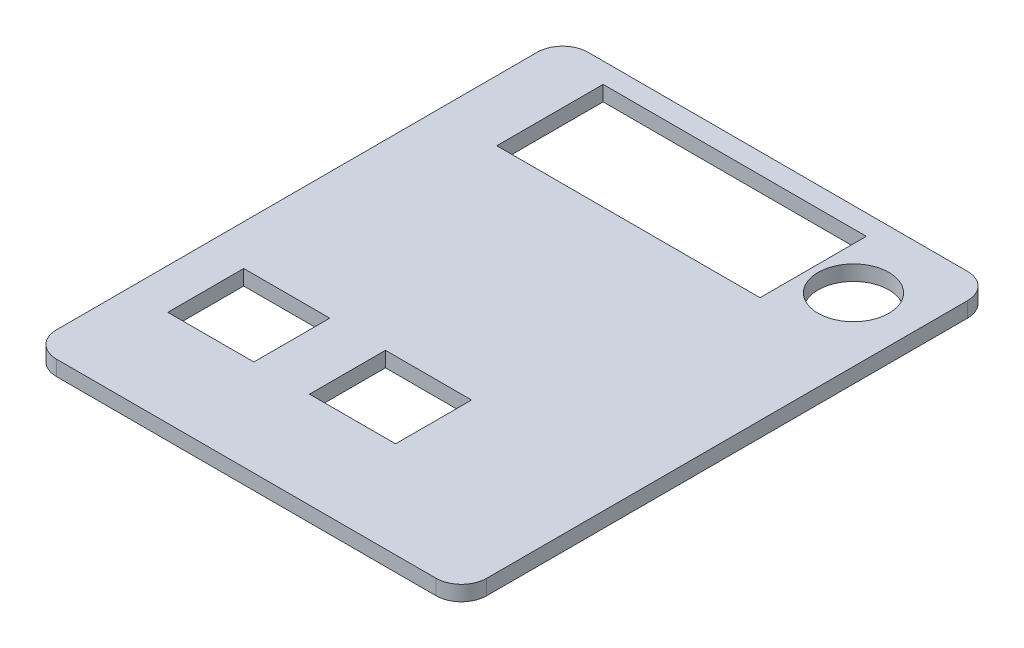
ISO-10303-21;
HEADER;
FILE_DESCRIPTION(('STEP AP214'),'2;1');
FILE_NAME('part.step','',(''),(''),'','','');
FILE_SCHEMA(('AUTOMOTIVE_DESIGN { 1 0 10303 214 1 1 1 1 }'));
ENDSEC;
DATA;
#1=APPLICATION_CONTEXT('core data for automotive mechanical design processes');
#2=APPLICATION_PROTOCOL_DEFINITION('international standard','automotive_design',2000,#1);
#3=PRODUCT_CONTEXT('',#1,'mechanical');
#4=PRODUCT('Part','Part','',(#3));
#5=PRODUCT_RELATED_PRODUCT_CATEGORY('part','',(#4));
#6=PRODUCT_DEFINITION_FORMATION('','',#4);
#7=PRODUCT_DEFINITION_CONTEXT('part definition',#1,'design');
#8=PRODUCT_DEFINITION('design','',#6,#7);
#9=PRODUCT_DEFINITION_SHAPE('','',#8);
#10=(LENGTH_UNIT() NAMED_UNIT(*) SI_UNIT(.MILLI.,.METRE.));
#11=(NAMED_UNIT(*) PLANE_ANGLE_UNIT() SI_UNIT($,.RADIAN.));
#12=(NAMED_UNIT(*) SI_UNIT($,.STERADIAN.) SOLID_ANGLE_UNIT());
#13=UNCERTAINTY_MEASURE_WITH_UNIT(LENGTH_MEASURE(1.E-05),#10,'distance_accuracy_value','');
#14=(GEOMETRIC_REPRESENTATION_CONTEXT(3) GLOBAL_UNCERTAINTY_ASSIGNED_CONTEXT((#13)) GLOBAL_UNIT_ASSIGNED_CONTEXT((#10,
#11,#12)) REPRESENTATION_CONTEXT('',''));
#15=CARTESIAN_POINT('',(0.,0.,0.));
#16=DIRECTION('',(0.,0.,1.));
#17=DIRECTION('',(1.,0.,0.));
#18=AXIS2_PLACEMENT_3D('',#15,#16,#17);
#19=CARTESIAN_POINT('',(42.5,3.,52.5));
#20=DIRECTION('',(-1.,0.,0.));
#21=DIRECTION('',(0.,0.,1.));
#22=AXIS2_PLACEMENT_3D('',#19,#20,#21);
#23=PLANE('',#22);
#24=DIRECTION('',(0.,0.,-1.));
#25=VECTOR('',#24,1.);
#26=CARTESIAN_POINT('',(42.5,0.,52.5));
#27=LINE('',#26,#25);
#28=CARTESIAN_POINT('',(42.5,0.,47.5));
#29=VERTEX_POINT('',#28);
#30=CARTESIAN_POINT('',(42.5,0.,-47.5));
#31=VERTEX_POINT('',#30);
#32=EDGE_CURVE('E237',#29,#31,#27,.T.);
#33=ORIENTED_EDGE('',*,*,#32,.T.);
#34=DIRECTION('',(0.,-1.,0.));
#35=VECTOR('',#34,1.);
#36=CARTESIAN_POINT('',(42.5,3.,-47.5));
#37=LINE('',#36,#35);
#38=CARTESIAN_POINT('',(42.5,3.,-47.5));
#39=VERTEX_POINT('',#38);
#40=EDGE_CURVE('E372',#31,#39,#37,.F.);
#41=ORIENTED_EDGE('',*,*,#40,.T.);
#42=DIRECTION('',(0.,0.,-1.));
#43=VECTOR('',#42,1.);
#44=CARTESIAN_POINT('',(42.5,3.,52.5));
#45=LINE('',#44,#43);
#46=CARTESIAN_POINT('',(42.5,3.,47.5));
#47=VERTEX_POINT('',#46);
#48=EDGE_CURVE('E273',#47,#39,#45,.T.);
#49=ORIENTED_EDGE('',*,*,#48,.F.);
#50=DIRECTION('',(0.,-1.,0.));
#51=VECTOR('',#50,1.);
#52=CARTESIAN_POINT('',(42.5,3.,47.5));
#53=LINE('',#52,#51);
#54=EDGE_CURVE('E368',#47,#29,#53,.T.);
#55=ORIENTED_EDGE('',*,*,#54,.T.);
#56=EDGE_LOOP('',(#33,#41,#49,#55));
#57=FACE_BOUND('',#56,.T.);
#58=ADVANCED_FACE('F43',(#57),#23,.F.);
#59=CARTESIAN_POINT('',(-42.5,3.,-52.5));
#60=DIRECTION('',(0.,0.,1.));
#61=DIRECTION('',(1.,0.,0.));
#62=AXIS2_PLACEMENT_3D('',#59,#60,#61);
#63=PLANE('',#62);
#64=DIRECTION('',(-1.,0.,0.));
#65=VECTOR('',#64,1.);
#66=CARTESIAN_POINT('',(-42.5,0.,-52.5));
#67=LINE('',#66,#65);
#68=CARTESIAN_POINT('',(37.5,0.,-52.5));
#69=VERTEX_POINT('',#68);
#70=CARTESIAN_POINT('',(-37.5,0.,-52.5));
#71=VERTEX_POINT('',#70);
#72=EDGE_CURVE('E294',#69,#71,#67,.T.);
#73=ORIENTED_EDGE('',*,*,#72,.T.);
#74=DIRECTION('',(0.,-1.,0.));
#75=VECTOR('',#74,1.);
#76=CARTESIAN_POINT('',(-37.5,3.,-52.5));
#77=LINE('',#76,#75);
#78=CARTESIAN_POINT('',(-37.5,3.,-52.5));
#79=VERTEX_POINT('',#78);
#80=EDGE_CURVE('E353',#71,#79,#77,.F.);
#81=ORIENTED_EDGE('',*,*,#80,.T.);
#82=DIRECTION('',(-1.,0.,0.));
#83=VECTOR('',#82,1.);
#84=CARTESIAN_POINT('',(-42.5,3.,-52.5));
#85=LINE('',#84,#83);
#86=CARTESIAN_POINT('',(37.5,3.,-52.5));
#87=VERTEX_POINT('',#86);
#88=EDGE_CURVE('E277',#87,#79,#85,.T.);
#89=ORIENTED_EDGE('',*,*,#88,.F.);
#90=DIRECTION('',(0.,-1.,0.));
#91=VECTOR('',#90,1.);
#92=CARTESIAN_POINT('',(37.5,3.,-52.5));
#93=LINE('',#92,#91);
#94=EDGE_CURVE('E349',#87,#69,#93,.T.);
#95=ORIENTED_EDGE('',*,*,#94,.T.);
#96=EDGE_LOOP('',(#73,#81,#89,#95));
#97=FACE_BOUND('',#96,.T.);
#98=ADVANCED_FACE('F423',(#97),#63,.F.);
#99=CARTESIAN_POINT('',(-42.5,3.,52.5));
#100=DIRECTION('',(1.,0.,0.));
#101=DIRECTION('',(0.,0.,-1.));
#102=AXIS2_PLACEMENT_3D('',#99,#100,#101);
#103=PLANE('',#102);
#104=DIRECTION('',(0.,0.,1.));
#105=VECTOR('',#104,1.);
#106=CARTESIAN_POINT('',(-42.5,3.,52.5));
#107=LINE('',#106,#105);
#108=CARTESIAN_POINT('',(-42.5,3.,-47.5));
#109=VERTEX_POINT('',#108);
#110=CARTESIAN_POINT('',(-42.5,3.,47.5));
#111=VERTEX_POINT('',#110);
#112=EDGE_CURVE('E282',#109,#111,#107,.T.);
#113=ORIENTED_EDGE('',*,*,#112,.F.);
#114=DIRECTION('',(0.,-1.,0.));
#115=VECTOR('',#114,1.);
#116=CARTESIAN_POINT('',(-42.5,3.,-47.5));
#117=LINE('',#116,#115);
#118=CARTESIAN_POINT('',(-42.5,0.,-47.5));
#119=VERTEX_POINT('',#118);
#120=EDGE_CURVE('E333',#109,#119,#117,.T.);
#121=ORIENTED_EDGE('',*,*,#120,.T.);
#122=DIRECTION('',(0.,0.,1.));
#123=VECTOR('',#122,1.);
#124=CARTESIAN_POINT('',(-42.5,0.,52.5));
#125=LINE('',#124,#123);
#126=CARTESIAN_POINT('',(-42.5,0.,47.5));
#127=VERTEX_POINT('',#126);
#128=EDGE_CURVE('E298',#119,#127,#125,.T.);
#129=ORIENTED_EDGE('',*,*,#128,.T.);
#130=DIRECTION('',(0.,-1.,0.));
#131=VECTOR('',#130,1.);
#132=CARTESIAN_POINT('',(-42.5,3.,47.5));
#133=LINE('',#132,#131);
#134=EDGE_CURVE('E330',#127,#111,#133,.F.);
#135=ORIENTED_EDGE('',*,*,#134,.T.);
#136=EDGE_LOOP('',(#113,#121,#129,#135));
#137=FACE_BOUND('',#136,.T.);
#138=ADVANCED_FACE('F418',(#137),#103,.F.);
#139=CARTESIAN_POINT('',(-42.5,3.,52.5));
#140=DIRECTION('',(0.,0.,-1.));
#141=DIRECTION('',(-1.,0.,0.));
#142=AXIS2_PLACEMENT_3D('',#139,#140,#141);
#143=PLANE('',#142);
#144=DIRECTION('',(1.,0.,0.));
#145=VECTOR('',#144,1.);
#146=CARTESIAN_POINT('',(-42.5,0.,52.5));
#147=LINE('',#146,#145);
#148=CARTESIAN_POINT('',(-37.5,0.,52.5));
#149=VERTEX_POINT('',#148);
#150=CARTESIAN_POINT('',(37.5,0.,52.5));
#151=VERTEX_POINT('',#150);
#152=EDGE_CURVE('E278',#149,#151,#147,.T.);
#153=ORIENTED_EDGE('',*,*,#152,.T.);
#154=DIRECTION('',(0.,-1.,0.));
#155=VECTOR('',#154,1.);
#156=CARTESIAN_POINT('',(37.5,3.,52.5));
#157=LINE('',#156,#155);
#158=CARTESIAN_POINT('',(37.5,3.,52.5));
#159=VERTEX_POINT('',#158);
#160=EDGE_CURVE('E379',#151,#159,#157,.F.);
#161=ORIENTED_EDGE('',*,*,#160,.T.);
#162=DIRECTION('',(1.,0.,0.));
#163=VECTOR('',#162,1.);
#164=CARTESIAN_POINT('',(-42.5,3.,52.5));
#165=LINE('',#164,#163);
#166=CARTESIAN_POINT('',(-37.5,3.,52.5));
#167=VERTEX_POINT('',#166);
#168=EDGE_CURVE('E286',#167,#159,#165,.T.);
#169=ORIENTED_EDGE('',*,*,#168,.F.);
#170=DIRECTION('',(0.,-1.,0.));
#171=VECTOR('',#170,1.);
#172=CARTESIAN_POINT('',(-37.5,3.,52.5));
#173=LINE('',#172,#171);
#174=EDGE_CURVE('E375',#167,#149,#173,.T.);
#175=ORIENTED_EDGE('',*,*,#174,.T.);
#176=EDGE_LOOP('',(#153,#161,#169,#175));
#177=FACE_BOUND('',#176,.T.);
#178=ADVANCED_FACE('F409',(#177),#143,.F.);
#179=CARTESIAN_POINT('',(0.,3.,0.));
#180=DIRECTION('',(0.,-1.,0.));
#181=DIRECTION('',(0.,0.,-1.));
#182=AXIS2_PLACEMENT_3D('',#179,#180,#181);
#183=PLANE('',#182);
#184=CARTESIAN_POINT('',(29.8979398668387,3.,-37.5653999961043));
#185=DIRECTION('',(0.,1.,0.));
#186=DIRECTION('',(0.,0.,1.));
#187=AXIS2_PLACEMENT_3D('',#184,#185,#186);
#188=CIRCLE('',#187,7.);
#189=CARTESIAN_POINT('',(29.8979398668387,3.,-30.5653999961043));
#190=VERTEX_POINT('',#189);
#191=EDGE_CURVE('E400',#190,#190,#188,.T.);
#192=ORIENTED_EDGE('',*,*,#191,.F.);
#193=EDGE_LOOP('',(#192));
#194=FACE_BOUND('',#193,.T.);
#195=DIRECTION('',(1.,0.,0.));
#196=VECTOR('',#195,1.);
#197=CARTESIAN_POINT('',(-30.5,3.,-27.5));
#198=LINE('',#197,#196);
#199=CARTESIAN_POINT('',(-30.5,3.,-27.5));
#200=VERTEX_POINT('',#199);
#201=CARTESIAN_POINT('',(21.5,3.,-27.5));
#202=VERTEX_POINT('',#201);
#203=EDGE_CURVE('E194',#200,#202,#198,.T.);
#204=ORIENTED_EDGE('',*,*,#203,.F.);
#205=DIRECTION('',(0.,0.,1.));
#206=VECTOR('',#205,1.);
#207=CARTESIAN_POINT('',(-30.5,3.,-48.5));
#208=LINE('',#207,#206);
#209=CARTESIAN_POINT('',(-30.5,3.,-48.5));
#210=VERTEX_POINT('',#209);
#211=EDGE_CURVE('E60',#210,#200,#208,.T.);
#212=ORIENTED_EDGE('',*,*,#211,.F.);
#213=DIRECTION('',(-1.,0.,0.));
#214=VECTOR('',#213,1.);
#215=CARTESIAN_POINT('',(-30.5,3.,-48.5));
#216=LINE('',#215,#214);
#217=CARTESIAN_POINT('',(21.5,3.,-48.5));
#218=VERTEX_POINT('',#217);
#219=EDGE_CURVE('E202',#218,#210,#216,.T.);
#220=ORIENTED_EDGE('',*,*,#219,.F.);
#221=DIRECTION('',(0.,0.,-1.));
#222=VECTOR('',#221,1.);
#223=CARTESIAN_POINT('',(21.5,3.,-48.5));
#224=LINE('',#223,#222);
#225=EDGE_CURVE('E184',#202,#218,#224,.T.);
#226=ORIENTED_EDGE('',*,*,#225,.F.);
#227=EDGE_LOOP('',(#204,#212,#220,#226));
#228=FACE_BOUND('',#227,.T.);
#229=DIRECTION('',(-1.,0.,0.));
#230=VECTOR('',#229,1.);
#231=CARTESIAN_POINT('',(-34.5,3.,18.5));
#232=LINE('',#231,#230);
#233=CARTESIAN_POINT('',(-17.5,3.,18.5));
#234=VERTEX_POINT('',#233);
#235=CARTESIAN_POINT('',(-34.5,3.,18.5));
#236=VERTEX_POINT('',#235);
#237=EDGE_CURVE('E220',#234,#236,#232,.T.);
#238=ORIENTED_EDGE('',*,*,#237,.F.);
#239=DIRECTION('',(0.,0.,-1.));
#240=VECTOR('',#239,1.);
#241=CARTESIAN_POINT('',(-17.5,3.,33.5));
#242=LINE('',#241,#240);
#243=CARTESIAN_POINT('',(-17.5,3.,33.5));
#244=VERTEX_POINT('',#243);
#245=EDGE_CURVE('E217',#244,#234,#242,.T.);
#246=ORIENTED_EDGE('',*,*,#245,.F.);
#247=DIRECTION('',(1.,0.,0.));
#248=VECTOR('',#247,1.);
#249=CARTESIAN_POINT('',(-34.5,3.,33.5));
#250=LINE('',#249,#248);
#251=CARTESIAN_POINT('',(-34.5,3.,33.5));
#252=VERTEX_POINT('',#251);
#253=EDGE_CURVE('E229',#252,#244,#250,.T.);
#254=ORIENTED_EDGE('',*,*,#253,.F.);
#255=DIRECTION('',(0.,0.,1.));
#256=VECTOR('',#255,1.);
#257=CARTESIAN_POINT('',(-34.5,3.,33.5));
#258=LINE('',#257,#256);
#259=EDGE_CURVE('E225',#236,#252,#258,.T.);
#260=ORIENTED_EDGE('',*,*,#259,.F.);
#261=EDGE_LOOP('',(#238,#246,#254,#260));
#262=FACE_BOUND('',#261,.T.);
#263=DIRECTION('',(-1.,0.,0.));
#264=VECTOR('',#263,1.);
#265=CARTESIAN_POINT('',(-6.50000000000003,3.,18.5));
#266=LINE('',#265,#264);
#267=CARTESIAN_POINT('',(10.5,3.,18.5));
#268=VERTEX_POINT('',#267);
#269=CARTESIAN_POINT('',(-6.50000000000003,3.,18.5));
#270=VERTEX_POINT('',#269);
#271=EDGE_CURVE('E249',#268,#270,#266,.T.);
#272=ORIENTED_EDGE('',*,*,#271,.F.);
#273=DIRECTION('',(0.,0.,-1.));
#274=VECTOR('',#273,1.);
#275=CARTESIAN_POINT('',(10.5,3.,33.5));
#276=LINE('',#275,#274);
#277=CARTESIAN_POINT('',(10.5,3.,33.5));
#278=VERTEX_POINT('',#277);
#279=EDGE_CURVE('E212',#278,#268,#276,.T.);
#280=ORIENTED_EDGE('',*,*,#279,.F.);
#281=DIRECTION('',(1.,0.,0.));
#282=VECTOR('',#281,1.);
#283=CARTESIAN_POINT('',(-6.50000000000003,3.,33.5));
#284=LINE('',#283,#282);
#285=CARTESIAN_POINT('',(-6.50000000000003,3.,33.5));
#286=VERTEX_POINT('',#285);
#287=EDGE_CURVE('E257',#286,#278,#284,.T.);
#288=ORIENTED_EDGE('',*,*,#287,.F.);
#289=DIRECTION('',(0.,0.,1.));
#290=VECTOR('',#289,1.);
#291=CARTESIAN_POINT('',(-6.50000000000003,3.,33.5));
#292=LINE('',#291,#290);
#293=EDGE_CURVE('E253',#270,#286,#292,.T.);
#294=ORIENTED_EDGE('',*,*,#293,.F.);
#295=EDGE_LOOP('',(#272,#280,#288,#294));
#296=FACE_BOUND('',#295,.T.);
#297=ORIENTED_EDGE('',*,*,#88,.T.);
#298=CARTESIAN_POINT('',(-37.5,3.,-47.5));
#299=DIRECTION('',(0.,-1.,0.));
#300=DIRECTION('',(0.,0.,-1.));
#301=AXIS2_PLACEMENT_3D('',#298,#299,#300);
#302=CIRCLE('',#301,5.);
#303=EDGE_CURVE('E365',#79,#109,#302,.F.);
#304=ORIENTED_EDGE('',*,*,#303,.T.);
#305=ORIENTED_EDGE('',*,*,#112,.T.);
#306=CARTESIAN_POINT('',(-37.5,3.,47.5));
#307=DIRECTION('',(0.,-1.,0.));
#308=DIRECTION('',(0.,0.,-1.));
#309=AXIS2_PLACEMENT_3D('',#306,#307,#308);
#310=CIRCLE('',#309,5.);
#311=EDGE_CURVE('E356',#111,#167,#310,.F.);
#312=ORIENTED_EDGE('',*,*,#311,.T.);
#313=ORIENTED_EDGE('',*,*,#168,.T.);
#314=CARTESIAN_POINT('',(37.5,3.,47.5));
#315=DIRECTION('',(0.,-1.,0.));
#316=DIRECTION('',(0.,0.,-1.));
#317=AXIS2_PLACEMENT_3D('',#314,#315,#316);
#318=CIRCLE('',#317,5.);
#319=EDGE_CURVE('E359',#159,#47,#318,.F.);
#320=ORIENTED_EDGE('',*,*,#319,.T.);
#321=ORIENTED_EDGE('',*,*,#48,.T.);
#322=CARTESIAN_POINT('',(37.5,3.,-47.5));
#323=DIRECTION('',(0.,-1.,0.));
#324=DIRECTION('',(0.,0.,-1.));
#325=AXIS2_PLACEMENT_3D('',#322,#323,#324);
#326=CIRCLE('',#325,5.);
#327=EDGE_CURVE('E362',#39,#87,#326,.F.);
#328=ORIENTED_EDGE('',*,*,#327,.T.);
#329=EDGE_LOOP('',(#297,#304,#305,#312,#313,#320,#321,#328));
#330=FACE_BOUND('',#329,.T.);
#331=ADVANCED_FACE('F199',(#194,#228,#262,#296,#330),#183,.F.);
#332=CARTESIAN_POINT('',(0.,0.,0.));
#333=DIRECTION('',(0.,-1.,0.));
#334=DIRECTION('',(0.,0.,-1.));
#335=AXIS2_PLACEMENT_3D('',#332,#333,#334);
#336=PLANE('',#335);
#337=CARTESIAN_POINT('',(29.8979398668387,0.,-37.5653999961043));
#338=DIRECTION('',(0.,-1.,0.));
#339=DIRECTION('',(0.,0.,-1.));
#340=AXIS2_PLACEMENT_3D('',#337,#338,#339);
#341=CIRCLE('',#340,7.);
#342=CARTESIAN_POINT('',(29.8979398668387,0.,-44.5653999961043));
#343=VERTEX_POINT('',#342);
#344=EDGE_CURVE('E47',#343,#343,#341,.T.);
#345=ORIENTED_EDGE('',*,*,#344,.F.);
#346=EDGE_LOOP('',(#345));
#347=FACE_BOUND('',#346,.T.);
#348=DIRECTION('',(0.,0.,-1.));
#349=VECTOR('',#348,1.);
#350=CARTESIAN_POINT('',(-30.5,0.,0.));
#351=LINE('',#350,#349);
#352=CARTESIAN_POINT('',(-30.5,0.,-27.5));
#353=VERTEX_POINT('',#352);
#354=CARTESIAN_POINT('',(-30.5,0.,-48.5));
#355=VERTEX_POINT('',#354);
#356=EDGE_CURVE('E11',#353,#355,#351,.T.);
#357=ORIENTED_EDGE('',*,*,#356,.F.);
#358=DIRECTION('',(-1.,0.,0.));
#359=VECTOR('',#358,1.);
#360=CARTESIAN_POINT('',(0.,0.,-27.5));
#361=LINE('',#360,#359);
#362=CARTESIAN_POINT('',(21.5,0.,-27.5));
#363=VERTEX_POINT('',#362);
#364=EDGE_CURVE('E382',#363,#353,#361,.T.);
#365=ORIENTED_EDGE('',*,*,#364,.F.);
#366=DIRECTION('',(0.,0.,1.));
#367=VECTOR('',#366,1.);
#368=CARTESIAN_POINT('',(21.5,0.,0.));
#369=LINE('',#368,#367);
#370=CARTESIAN_POINT('',(21.5,0.,-48.5));
#371=VERTEX_POINT('',#370);
#372=EDGE_CURVE('E187',#371,#363,#369,.T.);
#373=ORIENTED_EDGE('',*,*,#372,.F.);
#374=DIRECTION('',(1.,0.,0.));
#375=VECTOR('',#374,1.);
#376=CARTESIAN_POINT('',(0.,0.,-48.5));
#377=LINE('',#376,#375);
#378=EDGE_CURVE('E53',#355,#371,#377,.T.);
#379=ORIENTED_EDGE('',*,*,#378,.F.);
#380=EDGE_LOOP('',(#357,#365,#373,#379));
#381=FACE_BOUND('',#380,.T.);
#382=DIRECTION('',(0.,0.,1.));
#383=VECTOR('',#382,1.);
#384=CARTESIAN_POINT('',(-17.5,0.,0.));
#385=LINE('',#384,#383);
#386=CARTESIAN_POINT('',(-17.5,0.,18.5));
#387=VERTEX_POINT('',#386);
#388=CARTESIAN_POINT('',(-17.5,0.,33.5));
#389=VERTEX_POINT('',#388);
#390=EDGE_CURVE('E327',#387,#389,#385,.T.);
#391=ORIENTED_EDGE('',*,*,#390,.F.);
#392=DIRECTION('',(1.,0.,0.));
#393=VECTOR('',#392,1.);
#394=CARTESIAN_POINT('',(0.,0.,18.5));
#395=LINE('',#394,#393);
#396=CARTESIAN_POINT('',(-34.5,0.,18.5));
#397=VERTEX_POINT('',#396);
#398=EDGE_CURVE('E317',#397,#387,#395,.T.);
#399=ORIENTED_EDGE('',*,*,#398,.F.);
#400=DIRECTION('',(0.,0.,-1.));
#401=VECTOR('',#400,1.);
#402=CARTESIAN_POINT('',(-34.5,0.,0.));
#403=LINE('',#402,#401);
#404=CARTESIAN_POINT('',(-34.5,0.,33.5));
#405=VERTEX_POINT('',#404);
#406=EDGE_CURVE('E320',#405,#397,#403,.T.);
#407=ORIENTED_EDGE('',*,*,#406,.F.);
#408=DIRECTION('',(-1.,0.,0.));
#409=VECTOR('',#408,1.);
#410=CARTESIAN_POINT('',(0.,0.,33.5));
#411=LINE('',#410,#409);
#412=EDGE_CURVE('E324',#389,#405,#411,.T.);
#413=ORIENTED_EDGE('',*,*,#412,.F.);
#414=EDGE_LOOP('',(#391,#399,#407,#413));
#415=FACE_BOUND('',#414,.T.);
#416=DIRECTION('',(0.,0.,1.));
#417=VECTOR('',#416,1.);
#418=CARTESIAN_POINT('',(10.5,0.,0.));
#419=LINE('',#418,#417);
#420=CARTESIAN_POINT('',(10.5,0.,18.5));
#421=VERTEX_POINT('',#420);
#422=CARTESIAN_POINT('',(10.5,0.,33.5));
#423=VERTEX_POINT('',#422);
#424=EDGE_CURVE('E314',#421,#423,#419,.T.);
#425=ORIENTED_EDGE('',*,*,#424,.F.);
#426=DIRECTION('',(1.,0.,0.));
#427=VECTOR('',#426,1.);
#428=CARTESIAN_POINT('',(0.,0.,18.5));
#429=LINE('',#428,#427);
#430=CARTESIAN_POINT('',(-6.50000000000003,0.,18.5));
#431=VERTEX_POINT('',#430);
#432=EDGE_CURVE('E290',#431,#421,#429,.T.);
#433=ORIENTED_EDGE('',*,*,#432,.F.);
#434=DIRECTION('',(0.,0.,-1.));
#435=VECTOR('',#434,1.);
#436=CARTESIAN_POINT('',(-6.50000000000003,0.,0.));
#437=LINE('',#436,#435);
#438=CARTESIAN_POINT('',(-6.50000000000003,0.,33.5));
#439=VERTEX_POINT('',#438);
#440=EDGE_CURVE('E307',#439,#431,#437,.T.);
#441=ORIENTED_EDGE('',*,*,#440,.F.);
#442=DIRECTION('',(-1.,0.,0.));
#443=VECTOR('',#442,1.);
#444=CARTESIAN_POINT('',(0.,0.,33.5));
#445=LINE('',#444,#443);
#446=EDGE_CURVE('E311',#423,#439,#445,.T.);
#447=ORIENTED_EDGE('',*,*,#446,.F.);
#448=EDGE_LOOP('',(#425,#433,#441,#447));
#449=FACE_BOUND('',#448,.T.);
#450=ORIENTED_EDGE('',*,*,#128,.F.);
#451=CARTESIAN_POINT('',(-37.5,0.,-47.5));
#452=DIRECTION('',(0.,-1.,0.));
#453=DIRECTION('',(0.,0.,-1.));
#454=AXIS2_PLACEMENT_3D('',#451,#452,#453);
#455=CIRCLE('',#454,5.);
#456=EDGE_CURVE('E346',#119,#71,#455,.T.);
#457=ORIENTED_EDGE('',*,*,#456,.T.);
#458=ORIENTED_EDGE('',*,*,#72,.F.);
#459=CARTESIAN_POINT('',(37.5,0.,-47.5));
#460=DIRECTION('',(0.,-1.,0.));
#461=DIRECTION('',(0.,0.,-1.));
#462=AXIS2_PLACEMENT_3D('',#459,#460,#461);
#463=CIRCLE('',#462,5.);
#464=EDGE_CURVE('E343',#69,#31,#463,.T.);
#465=ORIENTED_EDGE('',*,*,#464,.T.);
#466=ORIENTED_EDGE('',*,*,#32,.F.);
#467=CARTESIAN_POINT('',(37.5,0.,47.5));
#468=DIRECTION('',(0.,-1.,0.));
#469=DIRECTION('',(0.,0.,-1.));
#470=AXIS2_PLACEMENT_3D('',#467,#468,#469);
#471=CIRCLE('',#470,5.);
#472=EDGE_CURVE('E340',#29,#151,#471,.T.);
#473=ORIENTED_EDGE('',*,*,#472,.T.);
#474=ORIENTED_EDGE('',*,*,#152,.F.);
#475=CARTESIAN_POINT('',(-37.5,0.,47.5));
#476=DIRECTION('',(0.,-1.,0.));
#477=DIRECTION('',(0.,0.,-1.));
#478=AXIS2_PLACEMENT_3D('',#475,#476,#477);
#479=CIRCLE('',#478,5.);
#480=EDGE_CURVE('E337',#149,#127,#479,.T.);
#481=ORIENTED_EDGE('',*,*,#480,.T.);
#482=EDGE_LOOP('',(#450,#457,#458,#465,#466,#473,#474,#481));
#483=FACE_BOUND('',#482,.T.);
#484=ADVANCED_FACE('F394',(#347,#381,#415,#449,#483),#336,.T.);
#485=CARTESIAN_POINT('',(10.5,-7.,33.5));
#486=DIRECTION('',(1.,0.,0.));
#487=DIRECTION('',(0.,0.,-1.));
#488=AXIS2_PLACEMENT_3D('',#485,#486,#487);
#489=PLANE('',#488);
#490=ORIENTED_EDGE('',*,*,#424,.T.);
#491=DIRECTION('',(0.,1.,0.));
#492=VECTOR('',#491,1.);
#493=CARTESIAN_POINT('',(10.5,-7.,33.5));
#494=LINE('',#493,#492);
#495=EDGE_CURVE('E221',#423,#278,#494,.T.);
#496=ORIENTED_EDGE('',*,*,#495,.T.);
#497=ORIENTED_EDGE('',*,*,#279,.T.);
#498=DIRECTION('',(0.,1.,0.));
#499=VECTOR('',#498,1.);
#500=CARTESIAN_POINT('',(10.5,-7.,18.5));
#501=LINE('',#500,#499);
#502=EDGE_CURVE('E261',#421,#268,#501,.T.);
#503=ORIENTED_EDGE('',*,*,#502,.F.);
#504=EDGE_LOOP('',(#490,#496,#497,#503));
#505=FACE_BOUND('',#504,.T.);
#506=ADVANCED_FACE('F415',(#505),#489,.F.);
#507=CARTESIAN_POINT('',(-6.50000000000003,-7.,33.5));
#508=DIRECTION('',(0.,0.,1.));
#509=DIRECTION('',(1.,0.,0.));
#510=AXIS2_PLACEMENT_3D('',#507,#508,#509);
#511=PLANE('',#510);
#512=ORIENTED_EDGE('',*,*,#446,.T.);
#513=DIRECTION('',(0.,1.,0.));
#514=VECTOR('',#513,1.);
#515=CARTESIAN_POINT('',(-6.50000000000003,-7.,33.5));
#516=LINE('',#515,#514);
#517=EDGE_CURVE('E264',#439,#286,#516,.T.);
#518=ORIENTED_EDGE('',*,*,#517,.T.);
#519=ORIENTED_EDGE('',*,*,#287,.T.);
#520=ORIENTED_EDGE('',*,*,#495,.F.);
#521=EDGE_LOOP('',(#512,#518,#519,#520));
#522=FACE_BOUND('',#521,.T.);
#523=ADVANCED_FACE('F577',(#522),#511,.F.);
#524=CARTESIAN_POINT('',(-6.50000000000003,-7.,33.5));
#525=DIRECTION('',(-1.,0.,0.));
#526=DIRECTION('',(0.,0.,1.));
#527=AXIS2_PLACEMENT_3D('',#524,#525,#526);
#528=PLANE('',#527);
#529=ORIENTED_EDGE('',*,*,#440,.T.);
#530=DIRECTION('',(0.,1.,0.));
#531=VECTOR('',#530,1.);
#532=CARTESIAN_POINT('',(-6.50000000000003,-7.,18.5));
#533=LINE('',#532,#531);
#534=EDGE_CURVE('E267',#431,#270,#533,.T.);
#535=ORIENTED_EDGE('',*,*,#534,.T.);
#536=ORIENTED_EDGE('',*,*,#293,.T.);
#537=ORIENTED_EDGE('',*,*,#517,.F.);
#538=EDGE_LOOP('',(#529,#535,#536,#537));
#539=FACE_BOUND('',#538,.T.);
#540=ADVANCED_FACE('F580',(#539),#528,.F.);
#541=CARTESIAN_POINT('',(-6.50000000000003,-7.,18.5));
#542=DIRECTION('',(0.,0.,-1.));
#543=DIRECTION('',(-1.,0.,0.));
#544=AXIS2_PLACEMENT_3D('',#541,#542,#543);
#545=PLANE('',#544);
#546=ORIENTED_EDGE('',*,*,#432,.T.);
#547=ORIENTED_EDGE('',*,*,#502,.T.);
#548=ORIENTED_EDGE('',*,*,#271,.T.);
#549=ORIENTED_EDGE('',*,*,#534,.F.);
#550=EDGE_LOOP('',(#546,#547,#548,#549));
#551=FACE_BOUND('',#550,.T.);
#552=ADVANCED_FACE('F575',(#551),#545,.F.);
#553=CARTESIAN_POINT('',(-17.5,-7.,33.5));
#554=DIRECTION('',(1.,0.,0.));
#555=DIRECTION('',(0.,0.,-1.));
#556=AXIS2_PLACEMENT_3D('',#553,#554,#555);
#557=PLANE('',#556);
#558=ORIENTED_EDGE('',*,*,#390,.T.);
#559=DIRECTION('',(0.,1.,0.));
#560=VECTOR('',#559,1.);
#561=CARTESIAN_POINT('',(-17.5,-7.,33.5));
#562=LINE('',#561,#560);
#563=EDGE_CURVE('E234',#389,#244,#562,.T.);
#564=ORIENTED_EDGE('',*,*,#563,.T.);
#565=ORIENTED_EDGE('',*,*,#245,.T.);
#566=DIRECTION('',(0.,1.,0.));
#567=VECTOR('',#566,1.);
#568=CARTESIAN_POINT('',(-17.5,-7.,18.5));
#569=LINE('',#568,#567);
#570=EDGE_CURVE('E233',#387,#234,#569,.T.);
#571=ORIENTED_EDGE('',*,*,#570,.F.);
#572=EDGE_LOOP('',(#558,#564,#565,#571));
#573=FACE_BOUND('',#572,.T.);
#574=ADVANCED_FACE('F566',(#573),#557,.F.);
#575=CARTESIAN_POINT('',(-34.5,-7.,33.5));
#576=DIRECTION('',(0.,0.,1.));
#577=DIRECTION('',(1.,0.,0.));
#578=AXIS2_PLACEMENT_3D('',#575,#576,#577);
#579=PLANE('',#578);
#580=ORIENTED_EDGE('',*,*,#412,.T.);
#581=DIRECTION('',(0.,1.,0.));
#582=VECTOR('',#581,1.);
#583=CARTESIAN_POINT('',(-34.5,-7.,33.5));
#584=LINE('',#583,#582);
#585=EDGE_CURVE('E238',#405,#252,#584,.T.);
#586=ORIENTED_EDGE('',*,*,#585,.T.);
#587=ORIENTED_EDGE('',*,*,#253,.T.);
#588=ORIENTED_EDGE('',*,*,#563,.F.);
#589=EDGE_LOOP('',(#580,#586,#587,#588));
#590=FACE_BOUND('',#589,.T.);
#591=ADVANCED_FACE('F562',(#590),#579,.F.);
#592=CARTESIAN_POINT('',(-34.5,-7.,33.5));
#593=DIRECTION('',(-1.,0.,0.));
#594=DIRECTION('',(0.,0.,1.));
#595=AXIS2_PLACEMENT_3D('',#592,#593,#594);
#596=PLANE('',#595);
#597=ORIENTED_EDGE('',*,*,#406,.T.);
#598=DIRECTION('',(0.,1.,0.));
#599=VECTOR('',#598,1.);
#600=CARTESIAN_POINT('',(-34.5,-7.,18.5));
#601=LINE('',#600,#599);
#602=EDGE_CURVE('E241',#397,#236,#601,.T.);
#603=ORIENTED_EDGE('',*,*,#602,.T.);
#604=ORIENTED_EDGE('',*,*,#259,.T.);
#605=ORIENTED_EDGE('',*,*,#585,.F.);
#606=EDGE_LOOP('',(#597,#603,#604,#605));
#607=FACE_BOUND('',#606,.T.);
#608=ADVANCED_FACE('F565',(#607),#596,.F.);
#609=CARTESIAN_POINT('',(-34.5,-7.,18.5));
#610=DIRECTION('',(0.,0.,-1.));
#611=DIRECTION('',(-1.,0.,0.));
#612=AXIS2_PLACEMENT_3D('',#609,#610,#611);
#613=PLANE('',#612);
#614=ORIENTED_EDGE('',*,*,#398,.T.);
#615=ORIENTED_EDGE('',*,*,#570,.T.);
#616=ORIENTED_EDGE('',*,*,#237,.T.);
#617=ORIENTED_EDGE('',*,*,#602,.F.);
#618=EDGE_LOOP('',(#614,#615,#616,#617));
#619=FACE_BOUND('',#618,.T.);
#620=ADVANCED_FACE('F437',(#619),#613,.F.);
#621=CARTESIAN_POINT('',(-37.5,3.,-47.5));
#622=DIRECTION('',(0.,-1.,0.));
#623=DIRECTION('',(0.,0.,-1.));
#624=AXIS2_PLACEMENT_3D('',#621,#622,#623);
#625=CYLINDRICAL_SURFACE('',#624,5.);
#626=ORIENTED_EDGE('',*,*,#303,.F.);
#627=ORIENTED_EDGE('',*,*,#80,.F.);
#628=ORIENTED_EDGE('',*,*,#456,.F.);
#629=ORIENTED_EDGE('',*,*,#120,.F.);
#630=EDGE_LOOP('',(#626,#627,#628,#629));
#631=FACE_BOUND('',#630,.T.);
#632=ADVANCED_FACE('F433',(#631),#625,.T.);
#633=CARTESIAN_POINT('',(37.5,3.,-47.5));
#634=DIRECTION('',(0.,-1.,0.));
#635=DIRECTION('',(0.,0.,-1.));
#636=AXIS2_PLACEMENT_3D('',#633,#634,#635);
#637=CYLINDRICAL_SURFACE('',#636,5.);
#638=ORIENTED_EDGE('',*,*,#327,.F.);
#639=ORIENTED_EDGE('',*,*,#40,.F.);
#640=ORIENTED_EDGE('',*,*,#464,.F.);
#641=ORIENTED_EDGE('',*,*,#94,.F.);
#642=EDGE_LOOP('',(#638,#639,#640,#641));
#643=FACE_BOUND('',#642,.T.);
#644=ADVANCED_FACE('F436',(#643),#637,.T.);
#645=CARTESIAN_POINT('',(37.5,3.,47.5));
#646=DIRECTION('',(0.,-1.,0.));
#647=DIRECTION('',(0.,0.,-1.));
#648=AXIS2_PLACEMENT_3D('',#645,#646,#647);
#649=CYLINDRICAL_SURFACE('',#648,5.);
#650=ORIENTED_EDGE('',*,*,#319,.F.);
#651=ORIENTED_EDGE('',*,*,#160,.F.);
#652=ORIENTED_EDGE('',*,*,#472,.F.);
#653=ORIENTED_EDGE('',*,*,#54,.F.);
#654=EDGE_LOOP('',(#650,#651,#652,#653));
#655=FACE_BOUND('',#654,.T.);
#656=ADVANCED_FACE('F440',(#655),#649,.T.);
#657=CARTESIAN_POINT('',(-37.5,3.,47.5));
#658=DIRECTION('',(0.,-1.,0.));
#659=DIRECTION('',(0.,0.,-1.));
#660=AXIS2_PLACEMENT_3D('',#657,#658,#659);
#661=CYLINDRICAL_SURFACE('',#660,5.);
#662=ORIENTED_EDGE('',*,*,#311,.F.);
#663=ORIENTED_EDGE('',*,*,#134,.F.);
#664=ORIENTED_EDGE('',*,*,#480,.F.);
#665=ORIENTED_EDGE('',*,*,#174,.F.);
#666=EDGE_LOOP('',(#662,#663,#664,#665));
#667=FACE_BOUND('',#666,.T.);
#668=ADVANCED_FACE('F45',(#667),#661,.T.);
#669=CARTESIAN_POINT('',(-30.5,-7.,-48.5));
#670=DIRECTION('',(-1.,0.,0.));
#671=DIRECTION('',(0.,0.,1.));
#672=AXIS2_PLACEMENT_3D('',#669,#670,#671);
#673=PLANE('',#672);
#674=ORIENTED_EDGE('',*,*,#356,.T.);
#675=DIRECTION('',(0.,1.,0.));
#676=VECTOR('',#675,1.);
#677=CARTESIAN_POINT('',(-30.5,-7.,-48.5));
#678=LINE('',#677,#676);
#679=EDGE_CURVE('E209',#355,#210,#678,.T.);
#680=ORIENTED_EDGE('',*,*,#679,.T.);
#681=ORIENTED_EDGE('',*,*,#211,.T.);
#682=DIRECTION('',(0.,1.,0.));
#683=VECTOR('',#682,1.);
#684=CARTESIAN_POINT('',(-30.5,-7.,-27.5));
#685=LINE('',#684,#683);
#686=EDGE_CURVE('E191',#353,#200,#685,.T.);
#687=ORIENTED_EDGE('',*,*,#686,.F.);
#688=EDGE_LOOP('',(#674,#680,#681,#687));
#689=FACE_BOUND('',#688,.T.);
#690=ADVANCED_FACE('F396',(#689),#673,.F.);
#691=CARTESIAN_POINT('',(-30.5,-7.,-48.5));
#692=DIRECTION('',(0.,0.,-1.));
#693=DIRECTION('',(-1.,0.,0.));
#694=AXIS2_PLACEMENT_3D('',#691,#692,#693);
#695=PLANE('',#694);
#696=ORIENTED_EDGE('',*,*,#378,.T.);
#697=DIRECTION('',(0.,1.,0.));
#698=VECTOR('',#697,1.);
#699=CARTESIAN_POINT('',(21.5,-7.,-48.5));
#700=LINE('',#699,#698);
#701=EDGE_CURVE('E190',#371,#218,#700,.T.);
#702=ORIENTED_EDGE('',*,*,#701,.T.);
#703=ORIENTED_EDGE('',*,*,#219,.T.);
#704=ORIENTED_EDGE('',*,*,#679,.F.);
#705=EDGE_LOOP('',(#696,#702,#703,#704));
#706=FACE_BOUND('',#705,.T.);
#707=ADVANCED_FACE('F391',(#706),#695,.F.);
#708=CARTESIAN_POINT('',(21.5,-7.,-48.5));
#709=DIRECTION('',(1.,0.,0.));
#710=DIRECTION('',(0.,0.,-1.));
#711=AXIS2_PLACEMENT_3D('',#708,#709,#710);
#712=PLANE('',#711);
#713=ORIENTED_EDGE('',*,*,#372,.T.);
#714=DIRECTION('',(0.,1.,0.));
#715=VECTOR('',#714,1.);
#716=CARTESIAN_POINT('',(21.5,-7.,-27.5));
#717=LINE('',#716,#715);
#718=EDGE_CURVE('E68',#363,#202,#717,.T.);
#719=ORIENTED_EDGE('',*,*,#718,.T.);
#720=ORIENTED_EDGE('',*,*,#225,.T.);
#721=ORIENTED_EDGE('',*,*,#701,.F.);
#722=EDGE_LOOP('',(#713,#719,#720,#721));
#723=FACE_BOUND('',#722,.T.);
#724=ADVANCED_FACE('F181',(#723),#712,.F.);
#725=CARTESIAN_POINT('',(-30.5,-7.,-27.5));
#726=DIRECTION('',(0.,0.,1.));
#727=DIRECTION('',(1.,0.,0.));
#728=AXIS2_PLACEMENT_3D('',#725,#726,#727);
#729=PLANE('',#728);
#730=ORIENTED_EDGE('',*,*,#364,.T.);
#731=ORIENTED_EDGE('',*,*,#686,.T.);
#732=ORIENTED_EDGE('',*,*,#203,.T.);
#733=ORIENTED_EDGE('',*,*,#718,.F.);
#734=EDGE_LOOP('',(#730,#731,#732,#733));
#735=FACE_BOUND('',#734,.T.);
#736=ADVANCED_FACE('F195',(#735),#729,.F.);
#737=CARTESIAN_POINT('',(29.8979398668387,-7.,-37.5653999961043));
#738=DIRECTION('',(0.,1.,0.));
#739=DIRECTION('',(0.,0.,1.));
#740=AXIS2_PLACEMENT_3D('',#737,#738,#739);
#741=CYLINDRICAL_SURFACE('',#740,7.);
#742=ORIENTED_EDGE('',*,*,#344,.T.);
#743=EDGE_LOOP('',(#742));
#744=FACE_BOUND('',#743,.T.);
#745=ORIENTED_EDGE('',*,*,#191,.T.);
#746=EDGE_LOOP('',(#745));
#747=FACE_BOUND('',#746,.T.);
#748=ADVANCED_FACE('F406',(#744,#747),#741,.F.);
#749=CLOSED_SHELL('',(#58,#98,#138,#178,#331,#484,#506,#523,#540,#552,#574,#591,#608,#620,#632,
#644,#656,#668,#690,#707,#724,#736,#748));
#750=MANIFOLD_SOLID_BREP('B2',#749);
#751=ADVANCED_BREP_SHAPE_REPRESENTATION('',(#18,#750),#14);
#752=SHAPE_DEFINITION_REPRESENTATION(#9,#751);
ENDSEC;
END-ISO-10303-21;
